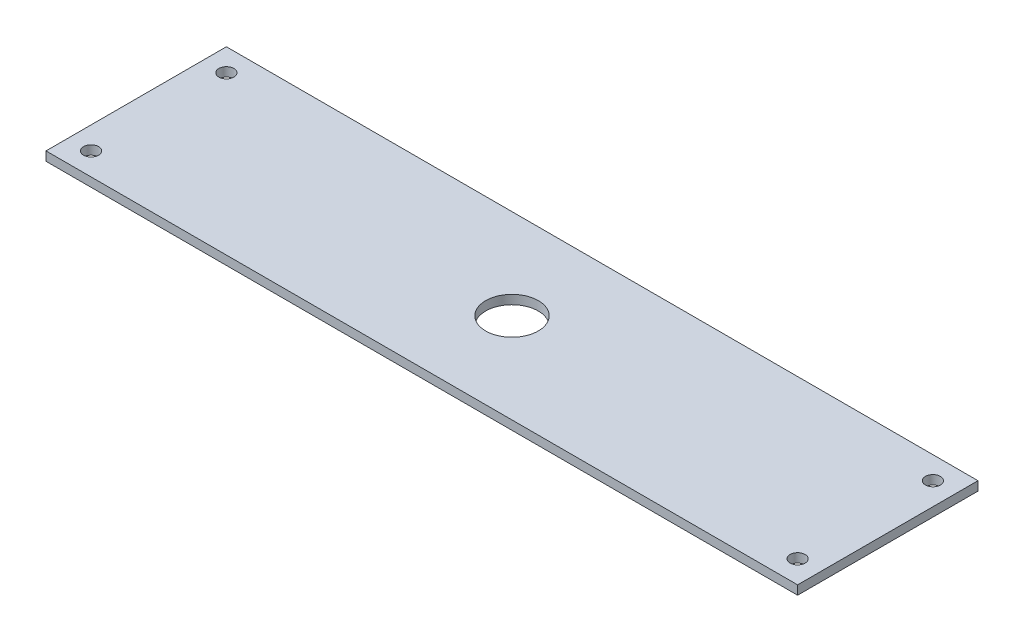
ISO-10303-21;
HEADER;
FILE_DESCRIPTION(('STEP AP214'),'2;1');
FILE_NAME('part.step','',(''),(''),'','','');
FILE_SCHEMA(('AUTOMOTIVE_DESIGN { 1 0 10303 214 1 1 1 1 }'));
ENDSEC;
DATA;
#1=APPLICATION_CONTEXT('core data for automotive mechanical design processes');
#2=APPLICATION_PROTOCOL_DEFINITION('international standard','automotive_design',2000,#1);
#3=PRODUCT_CONTEXT('',#1,'mechanical');
#4=PRODUCT('Part','Part','',(#3));
#5=PRODUCT_RELATED_PRODUCT_CATEGORY('part','',(#4));
#6=PRODUCT_DEFINITION_FORMATION('','',#4);
#7=PRODUCT_DEFINITION_CONTEXT('part definition',#1,'design');
#8=PRODUCT_DEFINITION('design','',#6,#7);
#9=PRODUCT_DEFINITION_SHAPE('','',#8);
#10=(LENGTH_UNIT() NAMED_UNIT(*) SI_UNIT(.MILLI.,.METRE.));
#11=(NAMED_UNIT(*) PLANE_ANGLE_UNIT() SI_UNIT($,.RADIAN.));
#12=(NAMED_UNIT(*) SI_UNIT($,.STERADIAN.) SOLID_ANGLE_UNIT());
#13=UNCERTAINTY_MEASURE_WITH_UNIT(LENGTH_MEASURE(1.E-05),#10,'distance_accuracy_value','');
#14=(GEOMETRIC_REPRESENTATION_CONTEXT(3) GLOBAL_UNCERTAINTY_ASSIGNED_CONTEXT((#13)) GLOBAL_UNIT_ASSIGNED_CONTEXT((#10,
#11,#12)) REPRESENTATION_CONTEXT('',''));
#15=CARTESIAN_POINT('',(0.,0.,0.));
#16=DIRECTION('',(0.,0.,1.));
#17=DIRECTION('',(1.,0.,0.));
#18=AXIS2_PLACEMENT_3D('',#15,#16,#17);
#19=CARTESIAN_POINT('',(0.,3.,0.));
#20=DIRECTION('',(0.,-1.,0.));
#21=DIRECTION('',(0.,0.,-1.));
#22=AXIS2_PLACEMENT_3D('',#19,#20,#21);
#23=PLANE('',#22);
#24=DIRECTION('',(0.,0.,-1.));
#25=VECTOR('',#24,1.);
#26=CARTESIAN_POINT('',(250.,3.,60.));
#27=LINE('',#26,#25);
#28=CARTESIAN_POINT('',(250.,3.,60.));
#29=VERTEX_POINT('',#28);
#30=CARTESIAN_POINT('',(250.,3.,-60.));
#31=VERTEX_POINT('',#30);
#32=EDGE_CURVE('E85',#29,#31,#27,.T.);
#33=ORIENTED_EDGE('',*,*,#32,.T.);
#34=DIRECTION('',(-1.,0.,0.));
#35=VECTOR('',#34,1.);
#36=CARTESIAN_POINT('',(-250.,3.,-60.));
#37=LINE('',#36,#35);
#38=CARTESIAN_POINT('',(-250.,3.,-60.));
#39=VERTEX_POINT('',#38);
#40=EDGE_CURVE('E80',#31,#39,#37,.T.);
#41=ORIENTED_EDGE('',*,*,#40,.T.);
#42=DIRECTION('',(0.,0.,1.));
#43=VECTOR('',#42,1.);
#44=CARTESIAN_POINT('',(-250.,3.,60.));
#45=LINE('',#44,#43);
#46=CARTESIAN_POINT('',(-250.,3.,60.));
#47=VERTEX_POINT('',#46);
#48=EDGE_CURVE('E83',#39,#47,#45,.T.);
#49=ORIENTED_EDGE('',*,*,#48,.T.);
#50=DIRECTION('',(1.,0.,0.));
#51=VECTOR('',#50,1.);
#52=CARTESIAN_POINT('',(-250.,3.,60.));
#53=LINE('',#52,#51);
#54=EDGE_CURVE('E50',#47,#29,#53,.T.);
#55=ORIENTED_EDGE('',*,*,#54,.T.);
#56=EDGE_LOOP('',(#33,#41,#49,#55));
#57=FACE_BOUND('',#56,.T.);
#58=CARTESIAN_POINT('',(0.,3.,0.));
#59=DIRECTION('',(0.,1.,0.));
#60=DIRECTION('',(0.,0.,1.));
#61=AXIS2_PLACEMENT_3D('',#58,#59,#60);
#62=CIRCLE('',#61,17.5);
#63=CARTESIAN_POINT('',(0.,3.,17.5));
#64=VERTEX_POINT('',#63);
#65=EDGE_CURVE('E100',#64,#64,#62,.T.);
#66=ORIENTED_EDGE('',*,*,#65,.F.);
#67=EDGE_LOOP('',(#66));
#68=FACE_BOUND('',#67,.T.);
#69=CARTESIAN_POINT('',(-235.,3.,-45.));
#70=DIRECTION('',(0.,1.,0.));
#71=DIRECTION('',(0.,0.,1.));
#72=AXIS2_PLACEMENT_3D('',#69,#70,#71);
#73=CIRCLE('',#72,4.99999999999999);
#74=CARTESIAN_POINT('',(-235.,3.,-40.));
#75=VERTEX_POINT('',#74);
#76=EDGE_CURVE('E115',#75,#75,#73,.T.);
#77=ORIENTED_EDGE('',*,*,#76,.F.);
#78=EDGE_LOOP('',(#77));
#79=FACE_BOUND('',#78,.T.);
#80=CARTESIAN_POINT('',(-235.,3.,45.));
#81=DIRECTION('',(0.,1.,0.));
#82=DIRECTION('',(0.,0.,-1.));
#83=AXIS2_PLACEMENT_3D('',#80,#81,#82);
#84=CIRCLE('',#83,4.99999999999999);
#85=CARTESIAN_POINT('',(-235.,3.,40.));
#86=VERTEX_POINT('',#85);
#87=EDGE_CURVE('E121',#86,#86,#84,.T.);
#88=ORIENTED_EDGE('',*,*,#87,.F.);
#89=EDGE_LOOP('',(#88));
#90=FACE_BOUND('',#89,.T.);
#91=CARTESIAN_POINT('',(235.,3.,-45.));
#92=DIRECTION('',(0.,1.,0.));
#93=DIRECTION('',(0.,0.,-1.));
#94=AXIS2_PLACEMENT_3D('',#91,#92,#93);
#95=CIRCLE('',#94,4.99999999999999);
#96=CARTESIAN_POINT('',(235.,3.,-50.));
#97=VERTEX_POINT('',#96);
#98=EDGE_CURVE('E127',#97,#97,#95,.T.);
#99=ORIENTED_EDGE('',*,*,#98,.F.);
#100=EDGE_LOOP('',(#99));
#101=FACE_BOUND('',#100,.T.);
#102=CARTESIAN_POINT('',(235.,3.,45.));
#103=DIRECTION('',(0.,1.,0.));
#104=DIRECTION('',(0.,0.,1.));
#105=AXIS2_PLACEMENT_3D('',#102,#103,#104);
#106=CIRCLE('',#105,4.99999999999999);
#107=CARTESIAN_POINT('',(235.,3.,50.));
#108=VERTEX_POINT('',#107);
#109=EDGE_CURVE('E133',#108,#108,#106,.T.);
#110=ORIENTED_EDGE('',*,*,#109,.F.);
#111=EDGE_LOOP('',(#110));
#112=FACE_BOUND('',#111,.T.);
#113=ADVANCED_FACE('F33',(#57,#68,#79,#90,#101,#112),#23,.F.);
#114=CARTESIAN_POINT('',(0.,-3.,0.));
#115=DIRECTION('',(0.,-1.,0.));
#116=DIRECTION('',(0.,0.,-1.));
#117=AXIS2_PLACEMENT_3D('',#114,#115,#116);
#118=PLANE('',#117);
#119=CARTESIAN_POINT('',(235.,-3.,-45.));
#120=DIRECTION('',(0.,1.,0.));
#121=DIRECTION('',(0.,0.,-1.));
#122=AXIS2_PLACEMENT_3D('',#119,#120,#121);
#123=CIRCLE('',#122,4.99999999999999);
#124=CARTESIAN_POINT('',(235.,-3.,-50.));
#125=VERTEX_POINT('',#124);
#126=EDGE_CURVE('E130',#125,#125,#123,.T.);
#127=ORIENTED_EDGE('',*,*,#126,.T.);
#128=EDGE_LOOP('',(#127));
#129=FACE_BOUND('',#128,.T.);
#130=CARTESIAN_POINT('',(-235.,-3.,-45.));
#131=DIRECTION('',(0.,1.,0.));
#132=DIRECTION('',(0.,0.,1.));
#133=AXIS2_PLACEMENT_3D('',#130,#131,#132);
#134=CIRCLE('',#133,4.99999999999999);
#135=CARTESIAN_POINT('',(-235.,-3.,-40.));
#136=VERTEX_POINT('',#135);
#137=EDGE_CURVE('E118',#136,#136,#134,.T.);
#138=ORIENTED_EDGE('',*,*,#137,.T.);
#139=EDGE_LOOP('',(#138));
#140=FACE_BOUND('',#139,.T.);
#141=DIRECTION('',(0.,0.,-1.));
#142=VECTOR('',#141,1.);
#143=CARTESIAN_POINT('',(250.,-3.,60.));
#144=LINE('',#143,#142);
#145=CARTESIAN_POINT('',(250.,-3.,60.));
#146=VERTEX_POINT('',#145);
#147=CARTESIAN_POINT('',(250.,-3.,-60.));
#148=VERTEX_POINT('',#147);
#149=EDGE_CURVE('E97',#146,#148,#144,.T.);
#150=ORIENTED_EDGE('',*,*,#149,.F.);
#151=DIRECTION('',(1.,0.,0.));
#152=VECTOR('',#151,1.);
#153=CARTESIAN_POINT('',(-250.,-3.,60.));
#154=LINE('',#153,#152);
#155=CARTESIAN_POINT('',(-250.,-3.,60.));
#156=VERTEX_POINT('',#155);
#157=EDGE_CURVE('E73',#156,#146,#154,.T.);
#158=ORIENTED_EDGE('',*,*,#157,.F.);
#159=DIRECTION('',(0.,0.,1.));
#160=VECTOR('',#159,1.);
#161=CARTESIAN_POINT('',(-250.,-3.,60.));
#162=LINE('',#161,#160);
#163=CARTESIAN_POINT('',(-250.,-3.,-60.));
#164=VERTEX_POINT('',#163);
#165=EDGE_CURVE('E67',#164,#156,#162,.T.);
#166=ORIENTED_EDGE('',*,*,#165,.F.);
#167=DIRECTION('',(-1.,0.,0.));
#168=VECTOR('',#167,1.);
#169=CARTESIAN_POINT('',(-250.,-3.,-60.));
#170=LINE('',#169,#168);
#171=EDGE_CURVE('E89',#148,#164,#170,.T.);
#172=ORIENTED_EDGE('',*,*,#171,.F.);
#173=EDGE_LOOP('',(#150,#158,#166,#172));
#174=FACE_BOUND('',#173,.T.);
#175=CARTESIAN_POINT('',(0.,-3.,0.));
#176=DIRECTION('',(0.,1.,0.));
#177=DIRECTION('',(0.,0.,1.));
#178=AXIS2_PLACEMENT_3D('',#175,#176,#177);
#179=CIRCLE('',#178,17.5);
#180=CARTESIAN_POINT('',(0.,-3.,17.5));
#181=VERTEX_POINT('',#180);
#182=EDGE_CURVE('E112',#181,#181,#179,.T.);
#183=ORIENTED_EDGE('',*,*,#182,.T.);
#184=EDGE_LOOP('',(#183));
#185=FACE_BOUND('',#184,.T.);
#186=CARTESIAN_POINT('',(-235.,-3.,45.));
#187=DIRECTION('',(0.,1.,0.));
#188=DIRECTION('',(0.,0.,-1.));
#189=AXIS2_PLACEMENT_3D('',#186,#187,#188);
#190=CIRCLE('',#189,4.99999999999999);
#191=CARTESIAN_POINT('',(-235.,-3.,40.));
#192=VERTEX_POINT('',#191);
#193=EDGE_CURVE('E124',#192,#192,#190,.T.);
#194=ORIENTED_EDGE('',*,*,#193,.T.);
#195=EDGE_LOOP('',(#194));
#196=FACE_BOUND('',#195,.T.);
#197=CARTESIAN_POINT('',(235.,-3.,45.));
#198=DIRECTION('',(0.,1.,0.));
#199=DIRECTION('',(0.,0.,1.));
#200=AXIS2_PLACEMENT_3D('',#197,#198,#199);
#201=CIRCLE('',#200,4.99999999999999);
#202=CARTESIAN_POINT('',(235.,-3.,50.));
#203=VERTEX_POINT('',#202);
#204=EDGE_CURVE('E136',#203,#203,#201,.T.);
#205=ORIENTED_EDGE('',*,*,#204,.T.);
#206=EDGE_LOOP('',(#205));
#207=FACE_BOUND('',#206,.T.);
#208=ADVANCED_FACE('F108',(#129,#140,#174,#185,#196,#207),#118,.T.);
#209=CARTESIAN_POINT('',(250.,3.,60.));
#210=DIRECTION('',(-1.,0.,0.));
#211=DIRECTION('',(0.,0.,1.));
#212=AXIS2_PLACEMENT_3D('',#209,#210,#211);
#213=PLANE('',#212);
#214=ORIENTED_EDGE('',*,*,#149,.T.);
#215=DIRECTION('',(0.,-1.,0.));
#216=VECTOR('',#215,1.);
#217=CARTESIAN_POINT('',(250.,3.,-60.));
#218=LINE('',#217,#216);
#219=EDGE_CURVE('E11',#31,#148,#218,.T.);
#220=ORIENTED_EDGE('',*,*,#219,.F.);
#221=ORIENTED_EDGE('',*,*,#32,.F.);
#222=DIRECTION('',(0.,-1.,0.));
#223=VECTOR('',#222,1.);
#224=CARTESIAN_POINT('',(250.,3.,60.));
#225=LINE('',#224,#223);
#226=EDGE_CURVE('E93',#29,#146,#225,.T.);
#227=ORIENTED_EDGE('',*,*,#226,.T.);
#228=EDGE_LOOP('',(#214,#220,#221,#227));
#229=FACE_BOUND('',#228,.T.);
#230=ADVANCED_FACE('F35',(#229),#213,.F.);
#231=CARTESIAN_POINT('',(-250.,3.,-60.));
#232=DIRECTION('',(0.,0.,1.));
#233=DIRECTION('',(1.,0.,0.));
#234=AXIS2_PLACEMENT_3D('',#231,#232,#233);
#235=PLANE('',#234);
#236=ORIENTED_EDGE('',*,*,#171,.T.);
#237=DIRECTION('',(0.,-1.,0.));
#238=VECTOR('',#237,1.);
#239=CARTESIAN_POINT('',(-250.,3.,-60.));
#240=LINE('',#239,#238);
#241=EDGE_CURVE('E42',#39,#164,#240,.T.);
#242=ORIENTED_EDGE('',*,*,#241,.F.);
#243=ORIENTED_EDGE('',*,*,#40,.F.);
#244=ORIENTED_EDGE('',*,*,#219,.T.);
#245=EDGE_LOOP('',(#236,#242,#243,#244));
#246=FACE_BOUND('',#245,.T.);
#247=ADVANCED_FACE('F88',(#246),#235,.F.);
#248=CARTESIAN_POINT('',(-250.,3.,60.));
#249=DIRECTION('',(1.,0.,0.));
#250=DIRECTION('',(0.,0.,-1.));
#251=AXIS2_PLACEMENT_3D('',#248,#249,#250);
#252=PLANE('',#251);
#253=ORIENTED_EDGE('',*,*,#165,.T.);
#254=DIRECTION('',(0.,-1.,0.));
#255=VECTOR('',#254,1.);
#256=CARTESIAN_POINT('',(-250.,3.,60.));
#257=LINE('',#256,#255);
#258=EDGE_CURVE('E90',#47,#156,#257,.T.);
#259=ORIENTED_EDGE('',*,*,#258,.F.);
#260=ORIENTED_EDGE('',*,*,#48,.F.);
#261=ORIENTED_EDGE('',*,*,#241,.T.);
#262=EDGE_LOOP('',(#253,#259,#260,#261));
#263=FACE_BOUND('',#262,.T.);
#264=ADVANCED_FACE('F91',(#263),#252,.F.);
#265=CARTESIAN_POINT('',(-250.,3.,60.));
#266=DIRECTION('',(0.,0.,-1.));
#267=DIRECTION('',(-1.,0.,0.));
#268=AXIS2_PLACEMENT_3D('',#265,#266,#267);
#269=PLANE('',#268);
#270=ORIENTED_EDGE('',*,*,#157,.T.);
#271=ORIENTED_EDGE('',*,*,#226,.F.);
#272=ORIENTED_EDGE('',*,*,#54,.F.);
#273=ORIENTED_EDGE('',*,*,#258,.T.);
#274=EDGE_LOOP('',(#270,#271,#272,#273));
#275=FACE_BOUND('',#274,.T.);
#276=ADVANCED_FACE('F105',(#275),#269,.F.);
#277=CARTESIAN_POINT('',(0.,3.,0.));
#278=DIRECTION('',(0.,-1.,0.));
#279=DIRECTION('',(0.,0.,-1.));
#280=AXIS2_PLACEMENT_3D('',#277,#278,#279);
#281=CYLINDRICAL_SURFACE('',#280,17.5);
#282=ORIENTED_EDGE('',*,*,#65,.T.);
#283=EDGE_LOOP('',(#282));
#284=FACE_BOUND('',#283,.T.);
#285=ORIENTED_EDGE('',*,*,#182,.F.);
#286=EDGE_LOOP('',(#285));
#287=FACE_BOUND('',#286,.T.);
#288=ADVANCED_FACE('F153',(#284,#287),#281,.F.);
#289=CARTESIAN_POINT('',(-235.,3.,-45.));
#290=DIRECTION('',(0.,-1.,0.));
#291=DIRECTION('',(0.,0.,-1.));
#292=AXIS2_PLACEMENT_3D('',#289,#290,#291);
#293=CYLINDRICAL_SURFACE('',#292,4.99999999999999);
#294=ORIENTED_EDGE('',*,*,#76,.T.);
#295=EDGE_LOOP('',(#294));
#296=FACE_BOUND('',#295,.T.);
#297=ORIENTED_EDGE('',*,*,#137,.F.);
#298=EDGE_LOOP('',(#297));
#299=FACE_BOUND('',#298,.T.);
#300=ADVANCED_FACE('F199',(#296,#299),#293,.F.);
#301=CARTESIAN_POINT('',(-235.,3.,45.));
#302=DIRECTION('',(0.,-1.,0.));
#303=DIRECTION('',(0.,0.,-1.));
#304=AXIS2_PLACEMENT_3D('',#301,#302,#303);
#305=CYLINDRICAL_SURFACE('',#304,4.99999999999999);
#306=ORIENTED_EDGE('',*,*,#87,.T.);
#307=EDGE_LOOP('',(#306));
#308=FACE_BOUND('',#307,.T.);
#309=ORIENTED_EDGE('',*,*,#193,.F.);
#310=EDGE_LOOP('',(#309));
#311=FACE_BOUND('',#310,.T.);
#312=ADVANCED_FACE('F207',(#308,#311),#305,.F.);
#313=CARTESIAN_POINT('',(235.,3.,-45.));
#314=DIRECTION('',(0.,-1.,0.));
#315=DIRECTION('',(0.,0.,-1.));
#316=AXIS2_PLACEMENT_3D('',#313,#314,#315);
#317=CYLINDRICAL_SURFACE('',#316,4.99999999999999);
#318=ORIENTED_EDGE('',*,*,#98,.T.);
#319=EDGE_LOOP('',(#318));
#320=FACE_BOUND('',#319,.T.);
#321=ORIENTED_EDGE('',*,*,#126,.F.);
#322=EDGE_LOOP('',(#321));
#323=FACE_BOUND('',#322,.T.);
#324=ADVANCED_FACE('F215',(#320,#323),#317,.F.);
#325=CARTESIAN_POINT('',(235.,3.,45.));
#326=DIRECTION('',(0.,-1.,0.));
#327=DIRECTION('',(0.,0.,-1.));
#328=AXIS2_PLACEMENT_3D('',#325,#326,#327);
#329=CYLINDRICAL_SURFACE('',#328,4.99999999999999);
#330=ORIENTED_EDGE('',*,*,#109,.T.);
#331=EDGE_LOOP('',(#330));
#332=FACE_BOUND('',#331,.T.);
#333=ORIENTED_EDGE('',*,*,#204,.F.);
#334=EDGE_LOOP('',(#333));
#335=FACE_BOUND('',#334,.T.);
#336=ADVANCED_FACE('F142',(#332,#335),#329,.F.);
#337=CLOSED_SHELL('',(#113,#208,#230,#247,#264,#276,#288,#300,#312,#324,#336));
#338=MANIFOLD_SOLID_BREP('B2',#337);
#339=ADVANCED_BREP_SHAPE_REPRESENTATION('',(#18,#338),#14);
#340=SHAPE_DEFINITION_REPRESENTATION(#9,#339);
ENDSEC;
END-ISO-10303-21;
